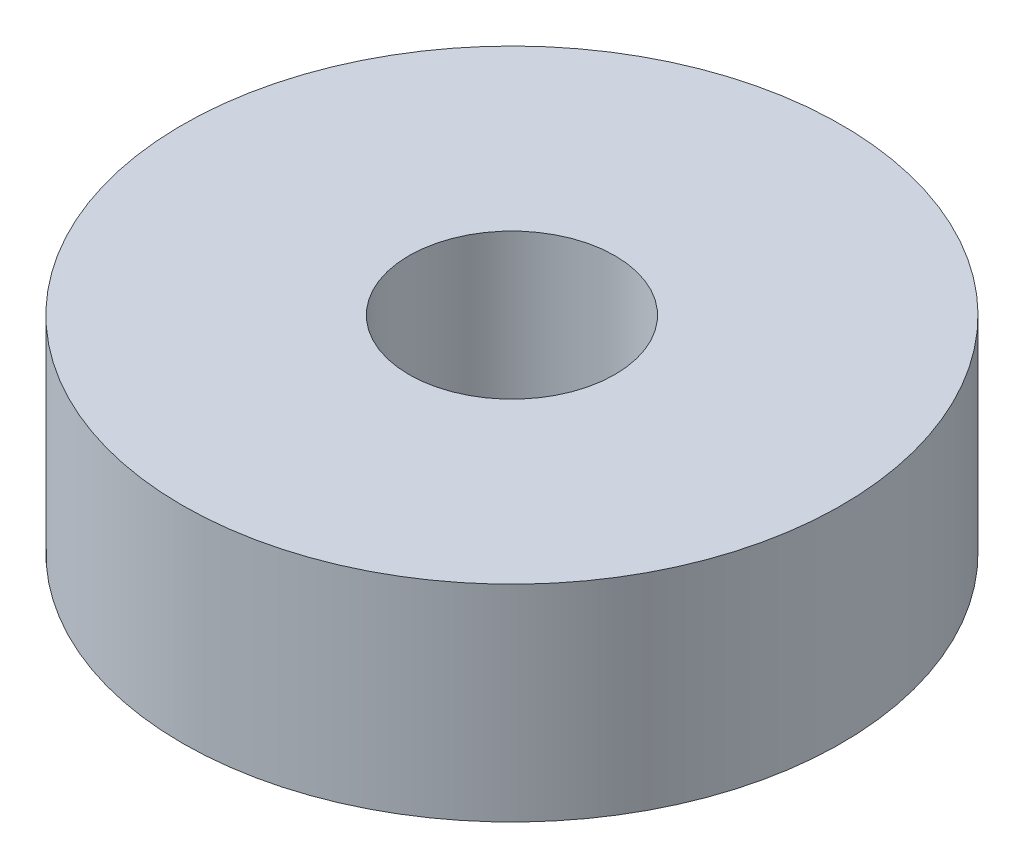
ISO-10303-21;
HEADER;
FILE_DESCRIPTION(('STEP AP214'),'2;1');
FILE_NAME('part.step','',(''),(''),'','','');
FILE_SCHEMA(('AUTOMOTIVE_DESIGN { 1 0 10303 214 1 1 1 1 }'));
ENDSEC;
DATA;
#1=APPLICATION_CONTEXT('core data for automotive mechanical design processes');
#2=APPLICATION_PROTOCOL_DEFINITION('international standard','automotive_design',2000,#1);
#3=PRODUCT_CONTEXT('',#1,'mechanical');
#4=PRODUCT('Part','Part','',(#3));
#5=PRODUCT_RELATED_PRODUCT_CATEGORY('part','',(#4));
#6=PRODUCT_DEFINITION_FORMATION('','',#4);
#7=PRODUCT_DEFINITION_CONTEXT('part definition',#1,'design');
#8=PRODUCT_DEFINITION('design','',#6,#7);
#9=PRODUCT_DEFINITION_SHAPE('','',#8);
#10=(LENGTH_UNIT() NAMED_UNIT(*) SI_UNIT(.MILLI.,.METRE.));
#11=(NAMED_UNIT(*) PLANE_ANGLE_UNIT() SI_UNIT($,.RADIAN.));
#12=(NAMED_UNIT(*) SI_UNIT($,.STERADIAN.) SOLID_ANGLE_UNIT());
#13=UNCERTAINTY_MEASURE_WITH_UNIT(LENGTH_MEASURE(1.E-05),#10,'distance_accuracy_value','');
#14=(GEOMETRIC_REPRESENTATION_CONTEXT(3) GLOBAL_UNCERTAINTY_ASSIGNED_CONTEXT((#13)) GLOBAL_UNIT_ASSIGNED_CONTEXT((#10,
#11,#12)) REPRESENTATION_CONTEXT('',''));
#15=CARTESIAN_POINT('',(0.,0.,0.));
#16=DIRECTION('',(0.,0.,1.));
#17=DIRECTION('',(1.,0.,0.));
#18=AXIS2_PLACEMENT_3D('',#15,#16,#17);
#19=CARTESIAN_POINT('',(0.,5.,0.));
#20=DIRECTION('',(0.,1.,0.));
#21=DIRECTION('',(0.,0.,1.));
#22=AXIS2_PLACEMENT_3D('',#19,#20,#21);
#23=PLANE('',#22);
#24=CARTESIAN_POINT('',(0.,5.,0.));
#25=DIRECTION('',(0.,1.,0.));
#26=DIRECTION('',(0.,0.,1.));
#27=AXIS2_PLACEMENT_3D('',#24,#25,#26);
#28=CIRCLE('',#27,8.);
#29=CARTESIAN_POINT('',(0.,5.,8.));
#30=VERTEX_POINT('',#29);
#31=EDGE_CURVE('E10',#30,#30,#28,.T.);
#32=ORIENTED_EDGE('',*,*,#31,.T.);
#33=EDGE_LOOP('',(#32));
#34=FACE_BOUND('',#33,.T.);
#35=CARTESIAN_POINT('',(0.,5.,0.));
#36=DIRECTION('',(0.,1.,0.));
#37=DIRECTION('',(0.,0.,1.));
#38=AXIS2_PLACEMENT_3D('',#35,#36,#37);
#39=CIRCLE('',#38,2.5);
#40=CARTESIAN_POINT('',(0.,5.,2.5));
#41=VERTEX_POINT('',#40);
#42=EDGE_CURVE('E48',#41,#41,#39,.T.);
#43=ORIENTED_EDGE('',*,*,#42,.F.);
#44=EDGE_LOOP('',(#43));
#45=FACE_BOUND('',#44,.T.);
#46=ADVANCED_FACE('F37',(#34,#45),#23,.T.);
#47=CARTESIAN_POINT('',(0.,0.,0.));
#48=DIRECTION('',(0.,1.,0.));
#49=DIRECTION('',(0.,0.,1.));
#50=AXIS2_PLACEMENT_3D('',#47,#48,#49);
#51=PLANE('',#50);
#52=CARTESIAN_POINT('',(0.,0.,0.));
#53=DIRECTION('',(0.,1.,0.));
#54=DIRECTION('',(0.,0.,1.));
#55=AXIS2_PLACEMENT_3D('',#52,#53,#54);
#56=CIRCLE('',#55,8.);
#57=CARTESIAN_POINT('',(0.,0.,8.));
#58=VERTEX_POINT('',#57);
#59=EDGE_CURVE('E41',#58,#58,#56,.T.);
#60=ORIENTED_EDGE('',*,*,#59,.F.);
#61=EDGE_LOOP('',(#60));
#62=FACE_BOUND('',#61,.T.);
#63=CARTESIAN_POINT('',(0.,0.,0.));
#64=DIRECTION('',(0.,1.,0.));
#65=DIRECTION('',(0.,0.,1.));
#66=AXIS2_PLACEMENT_3D('',#63,#64,#65);
#67=CIRCLE('',#66,2.5);
#68=CARTESIAN_POINT('',(0.,0.,2.5));
#69=VERTEX_POINT('',#68);
#70=EDGE_CURVE('E50',#69,#69,#67,.T.);
#71=ORIENTED_EDGE('',*,*,#70,.T.);
#72=EDGE_LOOP('',(#71));
#73=FACE_BOUND('',#72,.T.);
#74=ADVANCED_FACE('F60',(#62,#73),#51,.F.);
#75=CARTESIAN_POINT('',(0.,5.,0.));
#76=DIRECTION('',(0.,-1.,0.));
#77=DIRECTION('',(0.,0.,-1.));
#78=AXIS2_PLACEMENT_3D('',#75,#76,#77);
#79=CYLINDRICAL_SURFACE('',#78,8.);
#80=ORIENTED_EDGE('',*,*,#31,.F.);
#81=EDGE_LOOP('',(#80));
#82=FACE_BOUND('',#81,.T.);
#83=ORIENTED_EDGE('',*,*,#59,.T.);
#84=EDGE_LOOP('',(#83));
#85=FACE_BOUND('',#84,.T.);
#86=ADVANCED_FACE('F39',(#82,#85),#79,.T.);
#87=CARTESIAN_POINT('',(0.,5.,0.));
#88=DIRECTION('',(0.,-1.,0.));
#89=DIRECTION('',(0.,0.,-1.));
#90=AXIS2_PLACEMENT_3D('',#87,#88,#89);
#91=CYLINDRICAL_SURFACE('',#90,2.5);
#92=ORIENTED_EDGE('',*,*,#42,.T.);
#93=EDGE_LOOP('',(#92));
#94=FACE_BOUND('',#93,.T.);
#95=ORIENTED_EDGE('',*,*,#70,.F.);
#96=EDGE_LOOP('',(#95));
#97=FACE_BOUND('',#96,.T.);
#98=ADVANCED_FACE('F56',(#94,#97),#91,.F.);
#99=CLOSED_SHELL('',(#46,#74,#86,#98));
#100=MANIFOLD_SOLID_BREP('B2',#99);
#101=ADVANCED_BREP_SHAPE_REPRESENTATION('',(#18,#100),#14);
#102=SHAPE_DEFINITION_REPRESENTATION(#9,#101);
ENDSEC;
END-ISO-10303-21;
